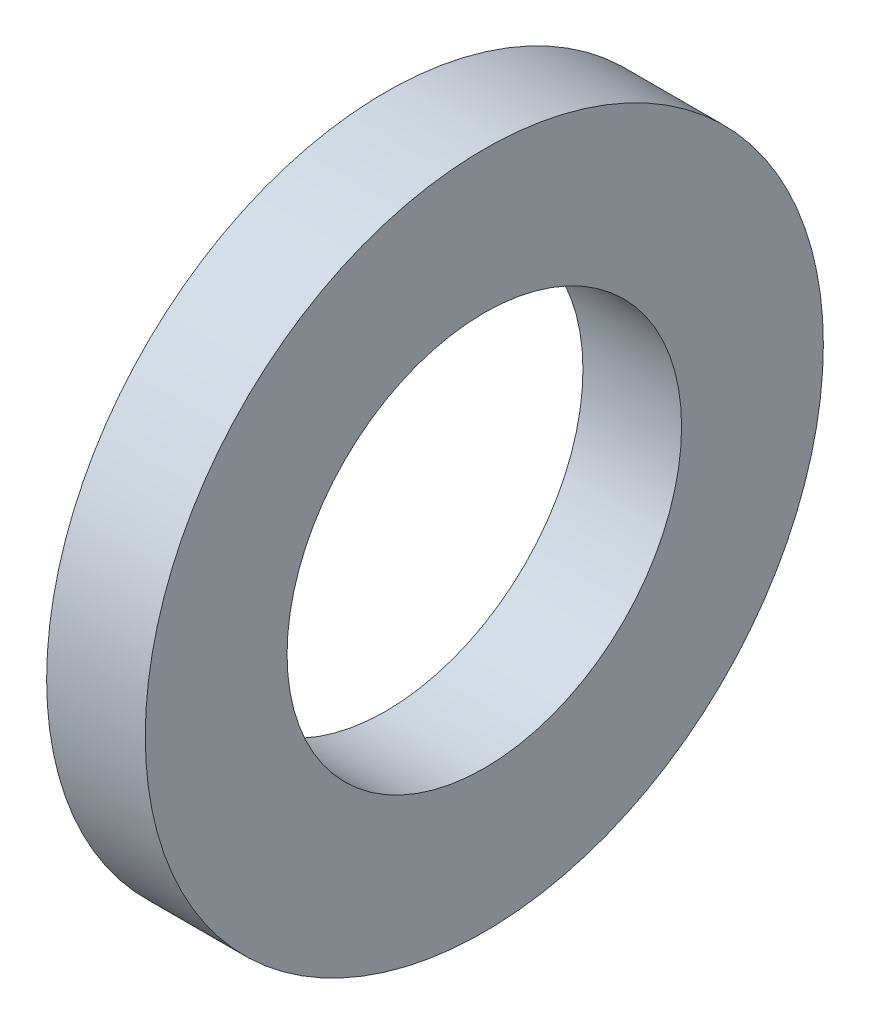
ISO-10303-21;
HEADER;
FILE_DESCRIPTION(('STEP AP214'),'2;1');
FILE_NAME('part.step','',(''),(''),'','','');
FILE_SCHEMA(('AUTOMOTIVE_DESIGN { 1 0 10303 214 1 1 1 1 }'));
ENDSEC;
DATA;
#1=APPLICATION_CONTEXT('core data for automotive mechanical design processes');
#2=APPLICATION_PROTOCOL_DEFINITION('international standard','automotive_design',2000,#1);
#3=PRODUCT_CONTEXT('',#1,'mechanical');
#4=PRODUCT('Part','Part','',(#3));
#5=PRODUCT_RELATED_PRODUCT_CATEGORY('part','',(#4));
#6=PRODUCT_DEFINITION_FORMATION('','',#4);
#7=PRODUCT_DEFINITION_CONTEXT('part definition',#1,'design');
#8=PRODUCT_DEFINITION('design','',#6,#7);
#9=PRODUCT_DEFINITION_SHAPE('','',#8);
#10=(LENGTH_UNIT() NAMED_UNIT(*) SI_UNIT(.MILLI.,.METRE.));
#11=(NAMED_UNIT(*) PLANE_ANGLE_UNIT() SI_UNIT($,.RADIAN.));
#12=(NAMED_UNIT(*) SI_UNIT($,.STERADIAN.) SOLID_ANGLE_UNIT());
#13=UNCERTAINTY_MEASURE_WITH_UNIT(LENGTH_MEASURE(1.E-05),#10,'distance_accuracy_value','');
#14=(GEOMETRIC_REPRESENTATION_CONTEXT(3) GLOBAL_UNCERTAINTY_ASSIGNED_CONTEXT((#13)) GLOBAL_UNIT_ASSIGNED_CONTEXT((#10,
#11,#12)) REPRESENTATION_CONTEXT('',''));
#15=CARTESIAN_POINT('',(0.,0.,0.));
#16=DIRECTION('',(0.,0.,1.));
#17=DIRECTION('',(1.,0.,0.));
#18=AXIS2_PLACEMENT_3D('',#15,#16,#17);
#19=CARTESIAN_POINT('',(-34.9249999999999,0.,0.));
#20=DIRECTION('',(-1.,0.,0.));
#21=DIRECTION('',(0.,0.,1.));
#22=AXIS2_PLACEMENT_3D('',#19,#20,#21);
#23=CYLINDRICAL_SURFACE('',#22,3.2);
#24=CARTESIAN_POINT('',(0.,0.,0.));
#25=DIRECTION('',(-1.,0.,0.));
#26=DIRECTION('',(0.,0.,1.));
#27=AXIS2_PLACEMENT_3D('',#24,#25,#26);
#28=CIRCLE('',#27,3.2);
#29=CARTESIAN_POINT('',(0.,0.,3.2));
#30=VERTEX_POINT('',#29);
#31=EDGE_CURVE('E10',#30,#30,#28,.T.);
#32=ORIENTED_EDGE('',*,*,#31,.F.);
#33=EDGE_LOOP('',(#32));
#34=FACE_BOUND('',#33,.T.);
#35=CARTESIAN_POINT('',(-1.6,0.,0.));
#36=DIRECTION('',(-1.,0.,0.));
#37=DIRECTION('',(0.,0.,1.));
#38=AXIS2_PLACEMENT_3D('',#35,#36,#37);
#39=CIRCLE('',#38,3.2);
#40=CARTESIAN_POINT('',(-1.6,0.,3.2));
#41=VERTEX_POINT('',#40);
#42=EDGE_CURVE('E44',#41,#41,#39,.T.);
#43=ORIENTED_EDGE('',*,*,#42,.T.);
#44=EDGE_LOOP('',(#43));
#45=FACE_BOUND('',#44,.T.);
#46=ADVANCED_FACE('F30',(#34,#45),#23,.F.);
#47=CARTESIAN_POINT('',(0.,3.2,0.));
#48=DIRECTION('',(-1.,0.,0.));
#49=DIRECTION('',(0.,0.,1.));
#50=AXIS2_PLACEMENT_3D('',#47,#48,#49);
#51=PLANE('',#50);
#52=CARTESIAN_POINT('',(0.,0.,0.));
#53=DIRECTION('',(-1.,0.,0.));
#54=DIRECTION('',(0.,0.,1.));
#55=AXIS2_PLACEMENT_3D('',#52,#53,#54);
#56=CIRCLE('',#55,5.5);
#57=CARTESIAN_POINT('',(0.,0.,5.5));
#58=VERTEX_POINT('',#57);
#59=EDGE_CURVE('E36',#58,#58,#56,.T.);
#60=ORIENTED_EDGE('',*,*,#59,.F.);
#61=EDGE_LOOP('',(#60));
#62=FACE_BOUND('',#61,.T.);
#63=ORIENTED_EDGE('',*,*,#31,.T.);
#64=EDGE_LOOP('',(#63));
#65=FACE_BOUND('',#64,.T.);
#66=ADVANCED_FACE('F59',(#62,#65),#51,.F.);
#67=CARTESIAN_POINT('',(-34.9249999999999,0.,0.));
#68=DIRECTION('',(-1.,0.,0.));
#69=DIRECTION('',(0.,0.,1.));
#70=AXIS2_PLACEMENT_3D('',#67,#68,#69);
#71=CYLINDRICAL_SURFACE('',#70,5.5);
#72=CARTESIAN_POINT('',(-1.6,0.,0.));
#73=DIRECTION('',(-1.,0.,0.));
#74=DIRECTION('',(0.,0.,1.));
#75=AXIS2_PLACEMENT_3D('',#72,#73,#74);
#76=CIRCLE('',#75,5.5);
#77=CARTESIAN_POINT('',(-1.6,0.,5.5));
#78=VERTEX_POINT('',#77);
#79=EDGE_CURVE('E40',#78,#78,#76,.T.);
#80=ORIENTED_EDGE('',*,*,#79,.F.);
#81=EDGE_LOOP('',(#80));
#82=FACE_BOUND('',#81,.T.);
#83=ORIENTED_EDGE('',*,*,#59,.T.);
#84=EDGE_LOOP('',(#83));
#85=FACE_BOUND('',#84,.T.);
#86=ADVANCED_FACE('F54',(#82,#85),#71,.T.);
#87=CARTESIAN_POINT('',(-1.6,5.5,0.));
#88=DIRECTION('',(1.,0.,0.));
#89=DIRECTION('',(0.,0.,-1.));
#90=AXIS2_PLACEMENT_3D('',#87,#88,#89);
#91=PLANE('',#90);
#92=ORIENTED_EDGE('',*,*,#42,.F.);
#93=EDGE_LOOP('',(#92));
#94=FACE_BOUND('',#93,.T.);
#95=ORIENTED_EDGE('',*,*,#79,.T.);
#96=EDGE_LOOP('',(#95));
#97=FACE_BOUND('',#96,.T.);
#98=ADVANCED_FACE('F51',(#94,#97),#91,.F.);
#99=CLOSED_SHELL('',(#46,#66,#86,#98));
#100=MANIFOLD_SOLID_BREP('B2',#99);
#101=ADVANCED_BREP_SHAPE_REPRESENTATION('',(#18,#100),#14);
#102=SHAPE_DEFINITION_REPRESENTATION(#9,#101);
ENDSEC;
END-ISO-10303-21;
